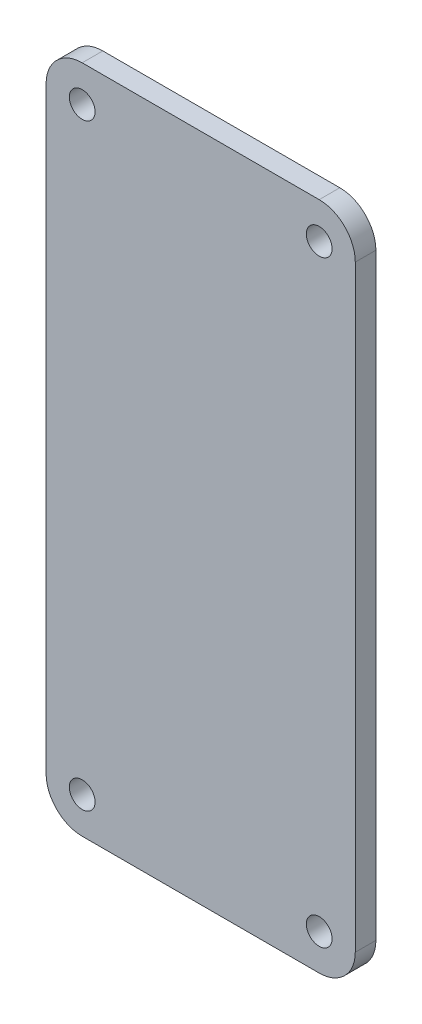
ISO-10303-21;
HEADER;
FILE_DESCRIPTION(('STEP AP214'),'2;1');
FILE_NAME('part.step','',(''),(''),'','','');
FILE_SCHEMA(('AUTOMOTIVE_DESIGN { 1 0 10303 214 1 1 1 1 }'));
ENDSEC;
DATA;
#1=APPLICATION_CONTEXT('core data for automotive mechanical design processes');
#2=APPLICATION_PROTOCOL_DEFINITION('international standard','automotive_design',2000,#1);
#3=PRODUCT_CONTEXT('',#1,'mechanical');
#4=PRODUCT('Part','Part','',(#3));
#5=PRODUCT_RELATED_PRODUCT_CATEGORY('part','',(#4));
#6=PRODUCT_DEFINITION_FORMATION('','',#4);
#7=PRODUCT_DEFINITION_CONTEXT('part definition',#1,'design');
#8=PRODUCT_DEFINITION('design','',#6,#7);
#9=PRODUCT_DEFINITION_SHAPE('','',#8);
#10=(LENGTH_UNIT() NAMED_UNIT(*) SI_UNIT(.MILLI.,.METRE.));
#11=(NAMED_UNIT(*) PLANE_ANGLE_UNIT() SI_UNIT($,.RADIAN.));
#12=(NAMED_UNIT(*) SI_UNIT($,.STERADIAN.) SOLID_ANGLE_UNIT());
#13=UNCERTAINTY_MEASURE_WITH_UNIT(LENGTH_MEASURE(1.E-05),#10,'distance_accuracy_value','');
#14=(GEOMETRIC_REPRESENTATION_CONTEXT(3) GLOBAL_UNCERTAINTY_ASSIGNED_CONTEXT((#13)) GLOBAL_UNIT_ASSIGNED_CONTEXT((#10,
#11,#12)) REPRESENTATION_CONTEXT('',''));
#15=CARTESIAN_POINT('',(0.,0.,0.));
#16=DIRECTION('',(0.,0.,1.));
#17=DIRECTION('',(1.,0.,0.));
#18=AXIS2_PLACEMENT_3D('',#15,#16,#17);
#19=CARTESIAN_POINT('',(205.999987496273,-193.470088204176,-6.38735862730539));
#20=DIRECTION('',(0.,0.,1.));
#21=DIRECTION('',(1.,0.,0.));
#22=AXIS2_PLACEMENT_3D('',#19,#20,#21);
#23=PLANE('',#22);
#24=CARTESIAN_POINT('',(194.499987496273,-164.470088204176,-6.38735862730539));
#25=DIRECTION('',(0.,0.,1.));
#26=DIRECTION('',(1.,0.,0.));
#27=AXIS2_PLACEMENT_3D('',#24,#25,#26);
#28=CIRCLE('',#27,1.25);
#29=CARTESIAN_POINT('',(195.749987496273,-164.470088204176,-6.38735862730539));
#30=VERTEX_POINT('',#29);
#31=EDGE_CURVE('E137',#30,#30,#28,.F.);
#32=ORIENTED_EDGE('',*,*,#31,.T.);
#33=EDGE_LOOP('',(#32));
#34=FACE_BOUND('',#33,.T.);
#35=CARTESIAN_POINT('',(194.499987496273,-222.470088204176,-6.38735862730539));
#36=DIRECTION('',(0.,0.,1.));
#37=DIRECTION('',(1.,0.,0.));
#38=AXIS2_PLACEMENT_3D('',#35,#36,#37);
#39=CIRCLE('',#38,1.25);
#40=CARTESIAN_POINT('',(195.749987496273,-222.470088204176,-6.38735862730539));
#41=VERTEX_POINT('',#40);
#42=EDGE_CURVE('E140',#41,#41,#39,.F.);
#43=ORIENTED_EDGE('',*,*,#42,.T.);
#44=EDGE_LOOP('',(#43));
#45=FACE_BOUND('',#44,.T.);
#46=CARTESIAN_POINT('',(217.499987496273,-222.470088204176,-6.38735862730539));
#47=DIRECTION('',(0.,0.,1.));
#48=DIRECTION('',(1.,0.,0.));
#49=AXIS2_PLACEMENT_3D('',#46,#47,#48);
#50=CIRCLE('',#49,1.25);
#51=CARTESIAN_POINT('',(218.749987496273,-222.470088204176,-6.38735862730539));
#52=VERTEX_POINT('',#51);
#53=EDGE_CURVE('E143',#52,#52,#50,.F.);
#54=ORIENTED_EDGE('',*,*,#53,.T.);
#55=EDGE_LOOP('',(#54));
#56=FACE_BOUND('',#55,.T.);
#57=CARTESIAN_POINT('',(217.499987496273,-164.470088204176,-6.38735862730539));
#58=DIRECTION('',(0.,0.,1.));
#59=DIRECTION('',(1.,0.,0.));
#60=AXIS2_PLACEMENT_3D('',#57,#58,#59);
#61=CIRCLE('',#60,1.25);
#62=CARTESIAN_POINT('',(218.749987496273,-164.470088204176,-6.38735862730539));
#63=VERTEX_POINT('',#62);
#64=EDGE_CURVE('E146',#63,#63,#61,.F.);
#65=ORIENTED_EDGE('',*,*,#64,.T.);
#66=EDGE_LOOP('',(#65));
#67=FACE_BOUND('',#66,.T.);
#68=CARTESIAN_POINT('',(194.499987496273,-222.470088204176,-6.38735862730539));
#69=DIRECTION('',(0.,0.,1.));
#70=DIRECTION('',(1.,0.,0.));
#71=AXIS2_PLACEMENT_3D('',#68,#69,#70);
#72=CIRCLE('',#71,3.5);
#73=CARTESIAN_POINT('',(194.499987496273,-225.970088204176,-6.38735862730539));
#74=VERTEX_POINT('',#73);
#75=CARTESIAN_POINT('',(190.999987496273,-222.470088204176,-6.38735862730539));
#76=VERTEX_POINT('',#75);
#77=EDGE_CURVE('E151',#74,#76,#72,.F.);
#78=ORIENTED_EDGE('',*,*,#77,.F.);
#79=DIRECTION('',(1.,0.,0.));
#80=VECTOR('',#79,1.);
#81=CARTESIAN_POINT('',(190.999987496273,-225.970088204176,-6.38735862730539));
#82=LINE('',#81,#80);
#83=CARTESIAN_POINT('',(217.499987496273,-225.970088204176,-6.38735862730539));
#84=VERTEX_POINT('',#83);
#85=EDGE_CURVE('E106',#84,#74,#82,.F.);
#86=ORIENTED_EDGE('',*,*,#85,.F.);
#87=CARTESIAN_POINT('',(217.499987496273,-222.470088204176,-6.38735862730539));
#88=DIRECTION('',(0.,0.,1.));
#89=DIRECTION('',(1.,0.,0.));
#90=AXIS2_PLACEMENT_3D('',#87,#88,#89);
#91=CIRCLE('',#90,3.5);
#92=CARTESIAN_POINT('',(220.999987496273,-222.470088204176,-6.38735862730539));
#93=VERTEX_POINT('',#92);
#94=EDGE_CURVE('E93',#93,#84,#91,.F.);
#95=ORIENTED_EDGE('',*,*,#94,.F.);
#96=DIRECTION('',(0.,1.,0.));
#97=VECTOR('',#96,1.);
#98=CARTESIAN_POINT('',(220.999987496273,-225.970088204176,-6.38735862730539));
#99=LINE('',#98,#97);
#100=CARTESIAN_POINT('',(220.999987496273,-164.470088204176,-6.38735862730539));
#101=VERTEX_POINT('',#100);
#102=EDGE_CURVE('E89',#101,#93,#99,.F.);
#103=ORIENTED_EDGE('',*,*,#102,.F.);
#104=CARTESIAN_POINT('',(217.499987496273,-164.470088204176,-6.38735862730539));
#105=DIRECTION('',(0.,0.,1.));
#106=DIRECTION('',(1.,0.,0.));
#107=AXIS2_PLACEMENT_3D('',#104,#105,#106);
#108=CIRCLE('',#107,3.5);
#109=CARTESIAN_POINT('',(217.499987496273,-160.970088204176,-6.38735862730539));
#110=VERTEX_POINT('',#109);
#111=EDGE_CURVE('E20',#110,#101,#108,.F.);
#112=ORIENTED_EDGE('',*,*,#111,.F.);
#113=DIRECTION('',(1.,0.,0.));
#114=VECTOR('',#113,1.);
#115=CARTESIAN_POINT('',(220.999987496273,-160.970088204176,-6.38735862730539));
#116=LINE('',#115,#114);
#117=CARTESIAN_POINT('',(194.499987496273,-160.970088204176,-6.38735862730539));
#118=VERTEX_POINT('',#117);
#119=EDGE_CURVE('E102',#118,#110,#116,.T.);
#120=ORIENTED_EDGE('',*,*,#119,.F.);
#121=CARTESIAN_POINT('',(194.499987496273,-164.470088204176,-6.38735862730539));
#122=DIRECTION('',(0.,0.,1.));
#123=DIRECTION('',(1.,0.,0.));
#124=AXIS2_PLACEMENT_3D('',#121,#122,#123);
#125=CIRCLE('',#124,3.5);
#126=CARTESIAN_POINT('',(190.999987496273,-164.470088204176,-6.38735862730539));
#127=VERTEX_POINT('',#126);
#128=EDGE_CURVE('E114',#127,#118,#125,.F.);
#129=ORIENTED_EDGE('',*,*,#128,.F.);
#130=DIRECTION('',(0.,1.,0.));
#131=VECTOR('',#130,1.);
#132=CARTESIAN_POINT('',(190.999987496273,-160.970088204176,-6.38735862730539));
#133=LINE('',#132,#131);
#134=EDGE_CURVE('E110',#76,#127,#133,.T.);
#135=ORIENTED_EDGE('',*,*,#134,.F.);
#136=EDGE_LOOP('',(#78,#86,#95,#103,#112,#120,#129,#135));
#137=FACE_BOUND('',#136,.T.);
#138=ADVANCED_FACE('F17',(#34,#45,#56,#67,#137),#23,.T.);
#139=CARTESIAN_POINT('',(220.999987496273,-225.970088204176,-8.38735862730539));
#140=DIRECTION('',(1.,0.,0.));
#141=DIRECTION('',(0.,0.,-1.));
#142=AXIS2_PLACEMENT_3D('',#139,#140,#141);
#143=PLANE('',#142);
#144=DIRECTION('',(0.,0.,1.));
#145=VECTOR('',#144,1.);
#146=CARTESIAN_POINT('',(220.999987496273,-164.470088204176,-8.38735862730539));
#147=LINE('',#146,#145);
#148=CARTESIAN_POINT('',(220.999987496273,-164.470088204176,-8.38735862730539));
#149=VERTEX_POINT('',#148);
#150=EDGE_CURVE('E86',#101,#149,#147,.F.);
#151=ORIENTED_EDGE('',*,*,#150,.F.);
#152=ORIENTED_EDGE('',*,*,#102,.T.);
#153=DIRECTION('',(0.,0.,1.));
#154=VECTOR('',#153,1.);
#155=CARTESIAN_POINT('',(220.999987496273,-222.470088204176,-8.38735862730539));
#156=LINE('',#155,#154);
#157=CARTESIAN_POINT('',(220.999987496273,-222.470088204176,-8.38735862730539));
#158=VERTEX_POINT('',#157);
#159=EDGE_CURVE('E149',#158,#93,#156,.T.);
#160=ORIENTED_EDGE('',*,*,#159,.F.);
#161=DIRECTION('',(0.,1.,0.));
#162=VECTOR('',#161,1.);
#163=CARTESIAN_POINT('',(220.999987496273,-193.470088204176,-8.38735862730539));
#164=LINE('',#163,#162);
#165=EDGE_CURVE('E100',#158,#149,#164,.T.);
#166=ORIENTED_EDGE('',*,*,#165,.T.);
#167=EDGE_LOOP('',(#151,#152,#160,#166));
#168=FACE_BOUND('',#167,.T.);
#169=ADVANCED_FACE('F99',(#168),#143,.T.);
#170=CARTESIAN_POINT('',(217.499987496273,-164.470088204176,-8.38735862730539));
#171=DIRECTION('',(0.,0.,1.));
#172=DIRECTION('',(1.,0.,0.));
#173=AXIS2_PLACEMENT_3D('',#170,#171,#172);
#174=CYLINDRICAL_SURFACE('',#173,3.5);
#175=CARTESIAN_POINT('',(217.499987496273,-164.470088204176,-8.38735862730539));
#176=DIRECTION('',(0.,0.,1.));
#177=DIRECTION('',(1.,0.,0.));
#178=AXIS2_PLACEMENT_3D('',#175,#176,#177);
#179=CIRCLE('',#178,3.5);
#180=CARTESIAN_POINT('',(217.499987496273,-160.970088204176,-8.38735862730539));
#181=VERTEX_POINT('',#180);
#182=EDGE_CURVE('E135',#149,#181,#179,.T.);
#183=ORIENTED_EDGE('',*,*,#182,.T.);
#184=DIRECTION('',(0.,0.,1.));
#185=VECTOR('',#184,1.);
#186=CARTESIAN_POINT('',(217.499987496273,-160.970088204176,-8.38735862730539));
#187=LINE('',#186,#185);
#188=EDGE_CURVE('E88',#110,#181,#187,.F.);
#189=ORIENTED_EDGE('',*,*,#188,.F.);
#190=ORIENTED_EDGE('',*,*,#111,.T.);
#191=ORIENTED_EDGE('',*,*,#150,.T.);
#192=EDGE_LOOP('',(#183,#189,#190,#191));
#193=FACE_BOUND('',#192,.T.);
#194=ADVANCED_FACE('F84',(#193),#174,.T.);
#195=CARTESIAN_POINT('',(220.999987496273,-160.970088204176,-8.38735862730539));
#196=DIRECTION('',(0.,1.,0.));
#197=DIRECTION('',(0.,0.,1.));
#198=AXIS2_PLACEMENT_3D('',#195,#196,#197);
#199=PLANE('',#198);
#200=DIRECTION('',(0.,0.,1.));
#201=VECTOR('',#200,1.);
#202=CARTESIAN_POINT('',(194.499987496273,-160.970088204176,-8.38735862730539));
#203=LINE('',#202,#201);
#204=CARTESIAN_POINT('',(194.499987496273,-160.970088204176,-8.38735862730539));
#205=VERTEX_POINT('',#204);
#206=EDGE_CURVE('E113',#118,#205,#203,.F.);
#207=ORIENTED_EDGE('',*,*,#206,.F.);
#208=ORIENTED_EDGE('',*,*,#119,.T.);
#209=ORIENTED_EDGE('',*,*,#188,.T.);
#210=DIRECTION('',(1.,0.,0.));
#211=VECTOR('',#210,1.);
#212=CARTESIAN_POINT('',(205.999987496273,-160.970088204176,-8.38735862730539));
#213=LINE('',#212,#211);
#214=EDGE_CURVE('E134',#181,#205,#213,.F.);
#215=ORIENTED_EDGE('',*,*,#214,.T.);
#216=EDGE_LOOP('',(#207,#208,#209,#215));
#217=FACE_BOUND('',#216,.T.);
#218=ADVANCED_FACE('F186',(#217),#199,.T.);
#219=CARTESIAN_POINT('',(194.499987496273,-164.470088204176,-8.38735862730539));
#220=DIRECTION('',(0.,0.,1.));
#221=DIRECTION('',(1.,0.,0.));
#222=AXIS2_PLACEMENT_3D('',#219,#220,#221);
#223=CYLINDRICAL_SURFACE('',#222,3.5);
#224=CARTESIAN_POINT('',(194.499987496273,-164.470088204176,-8.38735862730539));
#225=DIRECTION('',(0.,0.,1.));
#226=DIRECTION('',(1.,0.,0.));
#227=AXIS2_PLACEMENT_3D('',#224,#225,#226);
#228=CIRCLE('',#227,3.5);
#229=CARTESIAN_POINT('',(190.999987496273,-164.470088204176,-8.38735862730539));
#230=VERTEX_POINT('',#229);
#231=EDGE_CURVE('E131',#205,#230,#228,.T.);
#232=ORIENTED_EDGE('',*,*,#231,.T.);
#233=DIRECTION('',(0.,0.,1.));
#234=VECTOR('',#233,1.);
#235=CARTESIAN_POINT('',(190.999987496273,-164.470088204176,-8.38735862730539));
#236=LINE('',#235,#234);
#237=EDGE_CURVE('E112',#127,#230,#236,.F.);
#238=ORIENTED_EDGE('',*,*,#237,.F.);
#239=ORIENTED_EDGE('',*,*,#128,.T.);
#240=ORIENTED_EDGE('',*,*,#206,.T.);
#241=EDGE_LOOP('',(#232,#238,#239,#240));
#242=FACE_BOUND('',#241,.T.);
#243=ADVANCED_FACE('F184',(#242),#223,.T.);
#244=CARTESIAN_POINT('',(190.999987496273,-160.970088204176,-8.38735862730539));
#245=DIRECTION('',(-1.,0.,0.));
#246=DIRECTION('',(0.,0.,1.));
#247=AXIS2_PLACEMENT_3D('',#244,#245,#246);
#248=PLANE('',#247);
#249=ORIENTED_EDGE('',*,*,#237,.T.);
#250=DIRECTION('',(0.,1.,0.));
#251=VECTOR('',#250,1.);
#252=CARTESIAN_POINT('',(190.999987496273,-193.470088204176,-8.38735862730539));
#253=LINE('',#252,#251);
#254=CARTESIAN_POINT('',(190.999987496273,-222.470088204176,-8.38735862730539));
#255=VERTEX_POINT('',#254);
#256=EDGE_CURVE('E130',#230,#255,#253,.F.);
#257=ORIENTED_EDGE('',*,*,#256,.T.);
#258=DIRECTION('',(0.,0.,1.));
#259=VECTOR('',#258,1.);
#260=CARTESIAN_POINT('',(190.999987496273,-222.470088204176,-8.38735862730539));
#261=LINE('',#260,#259);
#262=EDGE_CURVE('E109',#76,#255,#261,.F.);
#263=ORIENTED_EDGE('',*,*,#262,.F.);
#264=ORIENTED_EDGE('',*,*,#134,.T.);
#265=EDGE_LOOP('',(#249,#257,#263,#264));
#266=FACE_BOUND('',#265,.T.);
#267=ADVANCED_FACE('F182',(#266),#248,.T.);
#268=CARTESIAN_POINT('',(194.499987496273,-222.470088204176,-8.38735862730539));
#269=DIRECTION('',(0.,0.,1.));
#270=DIRECTION('',(1.,0.,0.));
#271=AXIS2_PLACEMENT_3D('',#268,#269,#270);
#272=CYLINDRICAL_SURFACE('',#271,3.5);
#273=CARTESIAN_POINT('',(194.499987496273,-222.470088204176,-8.38735862730539));
#274=DIRECTION('',(0.,0.,1.));
#275=DIRECTION('',(1.,0.,0.));
#276=AXIS2_PLACEMENT_3D('',#273,#274,#275);
#277=CIRCLE('',#276,3.5);
#278=CARTESIAN_POINT('',(194.499987496273,-225.970088204176,-8.38735862730539));
#279=VERTEX_POINT('',#278);
#280=EDGE_CURVE('E127',#255,#279,#277,.T.);
#281=ORIENTED_EDGE('',*,*,#280,.T.);
#282=DIRECTION('',(0.,0.,-1.));
#283=VECTOR('',#282,1.);
#284=CARTESIAN_POINT('',(194.499987496273,-225.970088204176,-8.38735862730539));
#285=LINE('',#284,#283);
#286=EDGE_CURVE('E108',#74,#279,#285,.T.);
#287=ORIENTED_EDGE('',*,*,#286,.F.);
#288=ORIENTED_EDGE('',*,*,#77,.T.);
#289=ORIENTED_EDGE('',*,*,#262,.T.);
#290=EDGE_LOOP('',(#281,#287,#288,#289));
#291=FACE_BOUND('',#290,.T.);
#292=ADVANCED_FACE('F178',(#291),#272,.T.);
#293=CARTESIAN_POINT('',(190.999987496273,-225.970088204176,-8.38735862730539));
#294=DIRECTION('',(0.,-1.,0.));
#295=DIRECTION('',(0.,0.,-1.));
#296=AXIS2_PLACEMENT_3D('',#293,#294,#295);
#297=PLANE('',#296);
#298=ORIENTED_EDGE('',*,*,#286,.T.);
#299=DIRECTION('',(1.,0.,0.));
#300=VECTOR('',#299,1.);
#301=CARTESIAN_POINT('',(205.999987496273,-225.970088204176,-8.38735862730539));
#302=LINE('',#301,#300);
#303=CARTESIAN_POINT('',(217.499987496273,-225.970088204176,-8.38735862730539));
#304=VERTEX_POINT('',#303);
#305=EDGE_CURVE('E126',#279,#304,#302,.T.);
#306=ORIENTED_EDGE('',*,*,#305,.T.);
#307=DIRECTION('',(0.,0.,1.));
#308=VECTOR('',#307,1.);
#309=CARTESIAN_POINT('',(217.499987496273,-225.970088204176,-8.38735862730539));
#310=LINE('',#309,#308);
#311=EDGE_CURVE('E35',#84,#304,#310,.F.);
#312=ORIENTED_EDGE('',*,*,#311,.F.);
#313=ORIENTED_EDGE('',*,*,#85,.T.);
#314=EDGE_LOOP('',(#298,#306,#312,#313));
#315=FACE_BOUND('',#314,.T.);
#316=ADVANCED_FACE('F171',(#315),#297,.T.);
#317=CARTESIAN_POINT('',(217.499987496273,-222.470088204176,-8.38735862730539));
#318=DIRECTION('',(0.,0.,1.));
#319=DIRECTION('',(1.,0.,0.));
#320=AXIS2_PLACEMENT_3D('',#317,#318,#319);
#321=CYLINDRICAL_SURFACE('',#320,3.5);
#322=CARTESIAN_POINT('',(217.499987496273,-222.470088204176,-8.38735862730539));
#323=DIRECTION('',(0.,0.,1.));
#324=DIRECTION('',(1.,0.,0.));
#325=AXIS2_PLACEMENT_3D('',#322,#323,#324);
#326=CIRCLE('',#325,3.5);
#327=EDGE_CURVE('E124',#304,#158,#326,.T.);
#328=ORIENTED_EDGE('',*,*,#327,.T.);
#329=ORIENTED_EDGE('',*,*,#159,.T.);
#330=ORIENTED_EDGE('',*,*,#94,.T.);
#331=ORIENTED_EDGE('',*,*,#311,.T.);
#332=EDGE_LOOP('',(#328,#329,#330,#331));
#333=FACE_BOUND('',#332,.T.);
#334=ADVANCED_FACE('F219',(#333),#321,.T.);
#335=CARTESIAN_POINT('',(217.499987496273,-164.470088204176,-8.38735862730539));
#336=DIRECTION('',(0.,0.,1.));
#337=DIRECTION('',(1.,0.,0.));
#338=AXIS2_PLACEMENT_3D('',#335,#336,#337);
#339=CYLINDRICAL_SURFACE('',#338,1.25);
#340=CARTESIAN_POINT('',(217.499987496273,-164.470088204176,-8.38735862730539));
#341=DIRECTION('',(0.,0.,1.));
#342=DIRECTION('',(1.,0.,0.));
#343=AXIS2_PLACEMENT_3D('',#340,#341,#342);
#344=CIRCLE('',#343,1.25);
#345=CARTESIAN_POINT('',(218.749987496273,-164.470088204176,-8.38735862730539));
#346=VERTEX_POINT('',#345);
#347=EDGE_CURVE('E121',#346,#346,#344,.F.);
#348=ORIENTED_EDGE('',*,*,#347,.T.);
#349=EDGE_LOOP('',(#348));
#350=FACE_BOUND('',#349,.T.);
#351=ORIENTED_EDGE('',*,*,#64,.F.);
#352=EDGE_LOOP('',(#351));
#353=FACE_BOUND('',#352,.T.);
#354=ADVANCED_FACE('F215',(#350,#353),#339,.F.);
#355=CARTESIAN_POINT('',(217.499987496273,-222.470088204176,-8.38735862730539));
#356=DIRECTION('',(0.,0.,1.));
#357=DIRECTION('',(1.,0.,0.));
#358=AXIS2_PLACEMENT_3D('',#355,#356,#357);
#359=CYLINDRICAL_SURFACE('',#358,1.25);
#360=CARTESIAN_POINT('',(217.499987496273,-222.470088204176,-8.38735862730539));
#361=DIRECTION('',(0.,0.,1.));
#362=DIRECTION('',(1.,0.,0.));
#363=AXIS2_PLACEMENT_3D('',#360,#361,#362);
#364=CIRCLE('',#363,1.25);
#365=CARTESIAN_POINT('',(218.749987496273,-222.470088204176,-8.38735862730539));
#366=VERTEX_POINT('',#365);
#367=EDGE_CURVE('E118',#366,#366,#364,.F.);
#368=ORIENTED_EDGE('',*,*,#367,.T.);
#369=EDGE_LOOP('',(#368));
#370=FACE_BOUND('',#369,.T.);
#371=ORIENTED_EDGE('',*,*,#53,.F.);
#372=EDGE_LOOP('',(#371));
#373=FACE_BOUND('',#372,.T.);
#374=ADVANCED_FACE('F211',(#370,#373),#359,.F.);
#375=CARTESIAN_POINT('',(194.499987496273,-222.470088204176,-8.38735862730539));
#376=DIRECTION('',(0.,0.,1.));
#377=DIRECTION('',(1.,0.,0.));
#378=AXIS2_PLACEMENT_3D('',#375,#376,#377);
#379=CYLINDRICAL_SURFACE('',#378,1.25);
#380=CARTESIAN_POINT('',(194.499987496273,-222.470088204176,-8.38735862730539));
#381=DIRECTION('',(0.,0.,1.));
#382=DIRECTION('',(1.,0.,0.));
#383=AXIS2_PLACEMENT_3D('',#380,#381,#382);
#384=CIRCLE('',#383,1.25);
#385=CARTESIAN_POINT('',(195.749987496273,-222.470088204176,-8.38735862730539));
#386=VERTEX_POINT('',#385);
#387=EDGE_CURVE('E26',#386,#386,#384,.F.);
#388=ORIENTED_EDGE('',*,*,#387,.T.);
#389=EDGE_LOOP('',(#388));
#390=FACE_BOUND('',#389,.T.);
#391=ORIENTED_EDGE('',*,*,#42,.F.);
#392=EDGE_LOOP('',(#391));
#393=FACE_BOUND('',#392,.T.);
#394=ADVANCED_FACE('F203',(#390,#393),#379,.F.);
#395=CARTESIAN_POINT('',(194.499987496273,-164.470088204176,-8.38735862730539));
#396=DIRECTION('',(0.,0.,1.));
#397=DIRECTION('',(1.,0.,0.));
#398=AXIS2_PLACEMENT_3D('',#395,#396,#397);
#399=CYLINDRICAL_SURFACE('',#398,1.25);
#400=CARTESIAN_POINT('',(194.499987496273,-164.470088204176,-8.38735862730539));
#401=DIRECTION('',(0.,0.,1.));
#402=DIRECTION('',(1.,0.,0.));
#403=AXIS2_PLACEMENT_3D('',#400,#401,#402);
#404=CIRCLE('',#403,1.25);
#405=CARTESIAN_POINT('',(195.749987496273,-164.470088204176,-8.38735862730539));
#406=VERTEX_POINT('',#405);
#407=EDGE_CURVE('E11',#406,#406,#404,.F.);
#408=ORIENTED_EDGE('',*,*,#407,.T.);
#409=EDGE_LOOP('',(#408));
#410=FACE_BOUND('',#409,.T.);
#411=ORIENTED_EDGE('',*,*,#31,.F.);
#412=EDGE_LOOP('',(#411));
#413=FACE_BOUND('',#412,.T.);
#414=ADVANCED_FACE('F197',(#410,#413),#399,.F.);
#415=CARTESIAN_POINT('',(205.999987496273,-193.470088204176,-8.38735862730539));
#416=DIRECTION('',(0.,0.,1.));
#417=DIRECTION('',(1.,0.,0.));
#418=AXIS2_PLACEMENT_3D('',#415,#416,#417);
#419=PLANE('',#418);
#420=ORIENTED_EDGE('',*,*,#407,.F.);
#421=EDGE_LOOP('',(#420));
#422=FACE_BOUND('',#421,.T.);
#423=ORIENTED_EDGE('',*,*,#387,.F.);
#424=EDGE_LOOP('',(#423));
#425=FACE_BOUND('',#424,.T.);
#426=ORIENTED_EDGE('',*,*,#367,.F.);
#427=EDGE_LOOP('',(#426));
#428=FACE_BOUND('',#427,.T.);
#429=ORIENTED_EDGE('',*,*,#347,.F.);
#430=EDGE_LOOP('',(#429));
#431=FACE_BOUND('',#430,.T.);
#432=ORIENTED_EDGE('',*,*,#305,.F.);
#433=ORIENTED_EDGE('',*,*,#280,.F.);
#434=ORIENTED_EDGE('',*,*,#256,.F.);
#435=ORIENTED_EDGE('',*,*,#231,.F.);
#436=ORIENTED_EDGE('',*,*,#214,.F.);
#437=ORIENTED_EDGE('',*,*,#182,.F.);
#438=ORIENTED_EDGE('',*,*,#165,.F.);
#439=ORIENTED_EDGE('',*,*,#327,.F.);
#440=EDGE_LOOP('',(#432,#433,#434,#435,#436,#437,#438,#439));
#441=FACE_BOUND('',#440,.T.);
#442=ADVANCED_FACE('F175',(#422,#425,#428,#431,#441),#419,.F.);
#443=CLOSED_SHELL('',(#138,#169,#194,#218,#243,#267,#292,#316,#334,#354,#374,#394,#414,#442));
#444=MANIFOLD_SOLID_BREP('B1',#443);
#445=ADVANCED_BREP_SHAPE_REPRESENTATION('',(#18,#444),#14);
#446=SHAPE_DEFINITION_REPRESENTATION(#9,#445);
ENDSEC;
END-ISO-10303-21;
